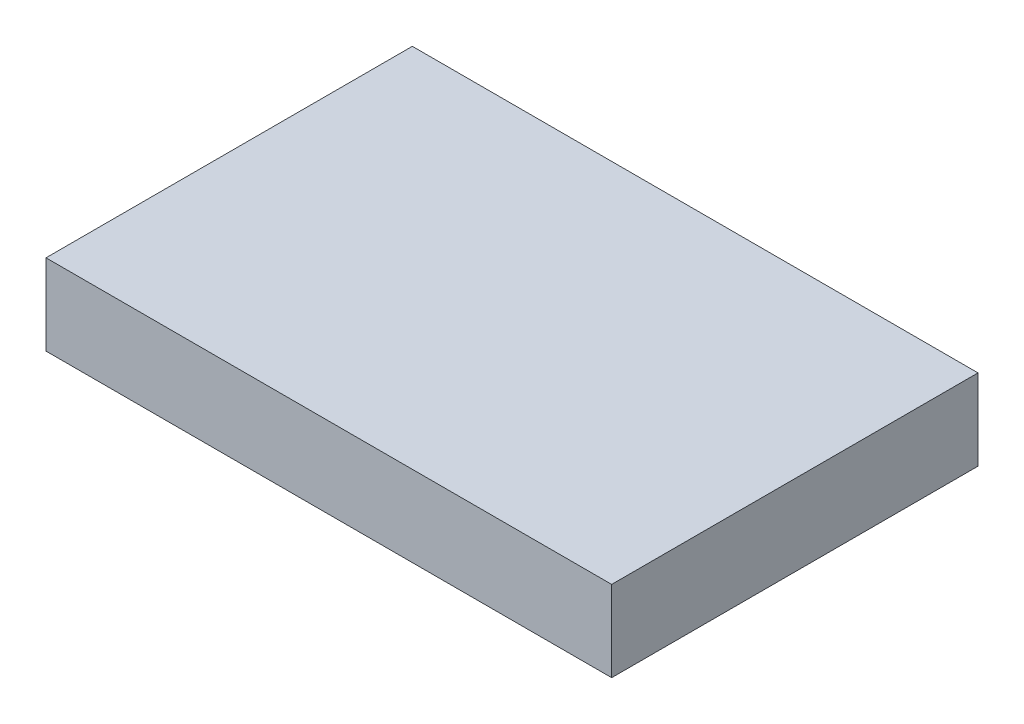
ISO-10303-21;
HEADER;
FILE_DESCRIPTION(('STEP AP214'),'2;1');
FILE_NAME('part.step','',(''),(''),'','','');
FILE_SCHEMA(('AUTOMOTIVE_DESIGN { 1 0 10303 214 1 1 1 1 }'));
ENDSEC;
DATA;
#1=APPLICATION_CONTEXT('core data for automotive mechanical design processes');
#2=APPLICATION_PROTOCOL_DEFINITION('international standard','automotive_design',2000,#1);
#3=PRODUCT_CONTEXT('',#1,'mechanical');
#4=PRODUCT('Part','Part','',(#3));
#5=PRODUCT_RELATED_PRODUCT_CATEGORY('part','',(#4));
#6=PRODUCT_DEFINITION_FORMATION('','',#4);
#7=PRODUCT_DEFINITION_CONTEXT('part definition',#1,'design');
#8=PRODUCT_DEFINITION('design','',#6,#7);
#9=PRODUCT_DEFINITION_SHAPE('','',#8);
#10=(LENGTH_UNIT() NAMED_UNIT(*) SI_UNIT(.MILLI.,.METRE.));
#11=(NAMED_UNIT(*) PLANE_ANGLE_UNIT() SI_UNIT($,.RADIAN.));
#12=(NAMED_UNIT(*) SI_UNIT($,.STERADIAN.) SOLID_ANGLE_UNIT());
#13=UNCERTAINTY_MEASURE_WITH_UNIT(LENGTH_MEASURE(1.E-05),#10,'distance_accuracy_value','');
#14=(GEOMETRIC_REPRESENTATION_CONTEXT(3) GLOBAL_UNCERTAINTY_ASSIGNED_CONTEXT((#13)) GLOBAL_UNIT_ASSIGNED_CONTEXT((#10,
#11,#12)) REPRESENTATION_CONTEXT('',''));
#15=CARTESIAN_POINT('',(0.,0.,0.));
#16=DIRECTION('',(0.,0.,1.));
#17=DIRECTION('',(1.,0.,0.));
#18=AXIS2_PLACEMENT_3D('',#15,#16,#17);
#19=CARTESIAN_POINT('',(0.,3.,0.));
#20=DIRECTION('',(1.,0.,0.));
#21=DIRECTION('',(0.,0.,-1.));
#22=AXIS2_PLACEMENT_3D('',#19,#20,#21);
#23=PLANE('',#22);
#24=DIRECTION('',(0.,0.,1.));
#25=VECTOR('',#24,1.);
#26=CARTESIAN_POINT('',(0.,0.,0.));
#27=LINE('',#26,#25);
#28=CARTESIAN_POINT('',(0.,0.,0.));
#29=VERTEX_POINT('',#28);
#30=CARTESIAN_POINT('',(0.,0.,13.6));
#31=VERTEX_POINT('',#30);
#32=EDGE_CURVE('E96',#29,#31,#27,.T.);
#33=ORIENTED_EDGE('',*,*,#32,.T.);
#34=DIRECTION('',(0.,-1.,0.));
#35=VECTOR('',#34,1.);
#36=CARTESIAN_POINT('',(0.,3.,13.6));
#37=LINE('',#36,#35);
#38=CARTESIAN_POINT('',(0.,3.,13.6));
#39=VERTEX_POINT('',#38);
#40=EDGE_CURVE('E11',#39,#31,#37,.T.);
#41=ORIENTED_EDGE('',*,*,#40,.F.);
#42=DIRECTION('',(0.,0.,1.));
#43=VECTOR('',#42,1.);
#44=CARTESIAN_POINT('',(0.,3.,0.));
#45=LINE('',#44,#43);
#46=CARTESIAN_POINT('',(0.,3.,0.));
#47=VERTEX_POINT('',#46);
#48=EDGE_CURVE('E84',#47,#39,#45,.T.);
#49=ORIENTED_EDGE('',*,*,#48,.F.);
#50=DIRECTION('',(0.,-1.,0.));
#51=VECTOR('',#50,1.);
#52=CARTESIAN_POINT('',(0.,3.,0.));
#53=LINE('',#52,#51);
#54=EDGE_CURVE('E92',#47,#29,#53,.T.);
#55=ORIENTED_EDGE('',*,*,#54,.T.);
#56=EDGE_LOOP('',(#33,#41,#49,#55));
#57=FACE_BOUND('',#56,.T.);
#58=ADVANCED_FACE('F33',(#57),#23,.F.);
#59=CARTESIAN_POINT('',(0.,3.,13.6));
#60=DIRECTION('',(0.,0.,-1.));
#61=DIRECTION('',(-1.,0.,0.));
#62=AXIS2_PLACEMENT_3D('',#59,#60,#61);
#63=PLANE('',#62);
#64=DIRECTION('',(1.,0.,0.));
#65=VECTOR('',#64,1.);
#66=CARTESIAN_POINT('',(0.,0.,13.6));
#67=LINE('',#66,#65);
#68=CARTESIAN_POINT('',(21.,0.,13.6));
#69=VERTEX_POINT('',#68);
#70=EDGE_CURVE('E88',#31,#69,#67,.T.);
#71=ORIENTED_EDGE('',*,*,#70,.T.);
#72=DIRECTION('',(0.,-1.,0.));
#73=VECTOR('',#72,1.);
#74=CARTESIAN_POINT('',(21.,3.,13.6));
#75=LINE('',#74,#73);
#76=CARTESIAN_POINT('',(21.,3.,13.6));
#77=VERTEX_POINT('',#76);
#78=EDGE_CURVE('E41',#77,#69,#75,.T.);
#79=ORIENTED_EDGE('',*,*,#78,.F.);
#80=DIRECTION('',(1.,0.,0.));
#81=VECTOR('',#80,1.);
#82=CARTESIAN_POINT('',(0.,3.,13.6));
#83=LINE('',#82,#81);
#84=EDGE_CURVE('E79',#39,#77,#83,.T.);
#85=ORIENTED_EDGE('',*,*,#84,.F.);
#86=ORIENTED_EDGE('',*,*,#40,.T.);
#87=EDGE_LOOP('',(#71,#79,#85,#86));
#88=FACE_BOUND('',#87,.T.);
#89=ADVANCED_FACE('F87',(#88),#63,.F.);
#90=CARTESIAN_POINT('',(21.,3.,0.));
#91=DIRECTION('',(-1.,0.,0.));
#92=DIRECTION('',(0.,0.,1.));
#93=AXIS2_PLACEMENT_3D('',#90,#91,#92);
#94=PLANE('',#93);
#95=DIRECTION('',(0.,0.,-1.));
#96=VECTOR('',#95,1.);
#97=CARTESIAN_POINT('',(21.,0.,0.));
#98=LINE('',#97,#96);
#99=CARTESIAN_POINT('',(21.,0.,0.));
#100=VERTEX_POINT('',#99);
#101=EDGE_CURVE('E66',#69,#100,#98,.T.);
#102=ORIENTED_EDGE('',*,*,#101,.T.);
#103=DIRECTION('',(0.,-1.,0.));
#104=VECTOR('',#103,1.);
#105=CARTESIAN_POINT('',(21.,3.,0.));
#106=LINE('',#105,#104);
#107=CARTESIAN_POINT('',(21.,3.,0.));
#108=VERTEX_POINT('',#107);
#109=EDGE_CURVE('E89',#108,#100,#106,.T.);
#110=ORIENTED_EDGE('',*,*,#109,.F.);
#111=DIRECTION('',(0.,0.,-1.));
#112=VECTOR('',#111,1.);
#113=CARTESIAN_POINT('',(21.,3.,0.));
#114=LINE('',#113,#112);
#115=EDGE_CURVE('E82',#77,#108,#114,.T.);
#116=ORIENTED_EDGE('',*,*,#115,.F.);
#117=ORIENTED_EDGE('',*,*,#78,.T.);
#118=EDGE_LOOP('',(#102,#110,#116,#117));
#119=FACE_BOUND('',#118,.T.);
#120=ADVANCED_FACE('F90',(#119),#94,.F.);
#121=CARTESIAN_POINT('',(0.,3.,0.));
#122=DIRECTION('',(0.,0.,1.));
#123=DIRECTION('',(1.,0.,0.));
#124=AXIS2_PLACEMENT_3D('',#121,#122,#123);
#125=PLANE('',#124);
#126=DIRECTION('',(-1.,0.,0.));
#127=VECTOR('',#126,1.);
#128=CARTESIAN_POINT('',(0.,0.,0.));
#129=LINE('',#128,#127);
#130=EDGE_CURVE('E72',#100,#29,#129,.T.);
#131=ORIENTED_EDGE('',*,*,#130,.T.);
#132=ORIENTED_EDGE('',*,*,#54,.F.);
#133=DIRECTION('',(-1.,0.,0.));
#134=VECTOR('',#133,1.);
#135=CARTESIAN_POINT('',(0.,3.,0.));
#136=LINE('',#135,#134);
#137=EDGE_CURVE('E49',#108,#47,#136,.T.);
#138=ORIENTED_EDGE('',*,*,#137,.F.);
#139=ORIENTED_EDGE('',*,*,#109,.T.);
#140=EDGE_LOOP('',(#131,#132,#138,#139));
#141=FACE_BOUND('',#140,.T.);
#142=ADVANCED_FACE('F103',(#141),#125,.F.);
#143=CARTESIAN_POINT('',(0.,3.,0.));
#144=DIRECTION('',(0.,1.,0.));
#145=DIRECTION('',(0.,0.,1.));
#146=AXIS2_PLACEMENT_3D('',#143,#144,#145);
#147=PLANE('',#146);
#148=ORIENTED_EDGE('',*,*,#48,.T.);
#149=ORIENTED_EDGE('',*,*,#84,.T.);
#150=ORIENTED_EDGE('',*,*,#115,.T.);
#151=ORIENTED_EDGE('',*,*,#137,.T.);
#152=EDGE_LOOP('',(#148,#149,#150,#151));
#153=FACE_BOUND('',#152,.T.);
#154=ADVANCED_FACE('F80',(#153),#147,.T.);
#155=CARTESIAN_POINT('',(0.,0.,0.));
#156=DIRECTION('',(0.,1.,0.));
#157=DIRECTION('',(0.,0.,1.));
#158=AXIS2_PLACEMENT_3D('',#155,#156,#157);
#159=PLANE('',#158);
#160=ORIENTED_EDGE('',*,*,#32,.F.);
#161=ORIENTED_EDGE('',*,*,#130,.F.);
#162=ORIENTED_EDGE('',*,*,#101,.F.);
#163=ORIENTED_EDGE('',*,*,#70,.F.);
#164=EDGE_LOOP('',(#160,#161,#162,#163));
#165=FACE_BOUND('',#164,.T.);
#166=ADVANCED_FACE('F106',(#165),#159,.F.);
#167=CLOSED_SHELL('',(#58,#89,#120,#142,#154,#166));
#168=MANIFOLD_SOLID_BREP('B2',#167);
#169=ADVANCED_BREP_SHAPE_REPRESENTATION('',(#18,#168),#14);
#170=SHAPE_DEFINITION_REPRESENTATION(#9,#169);
ENDSEC;
END-ISO-10303-21;
